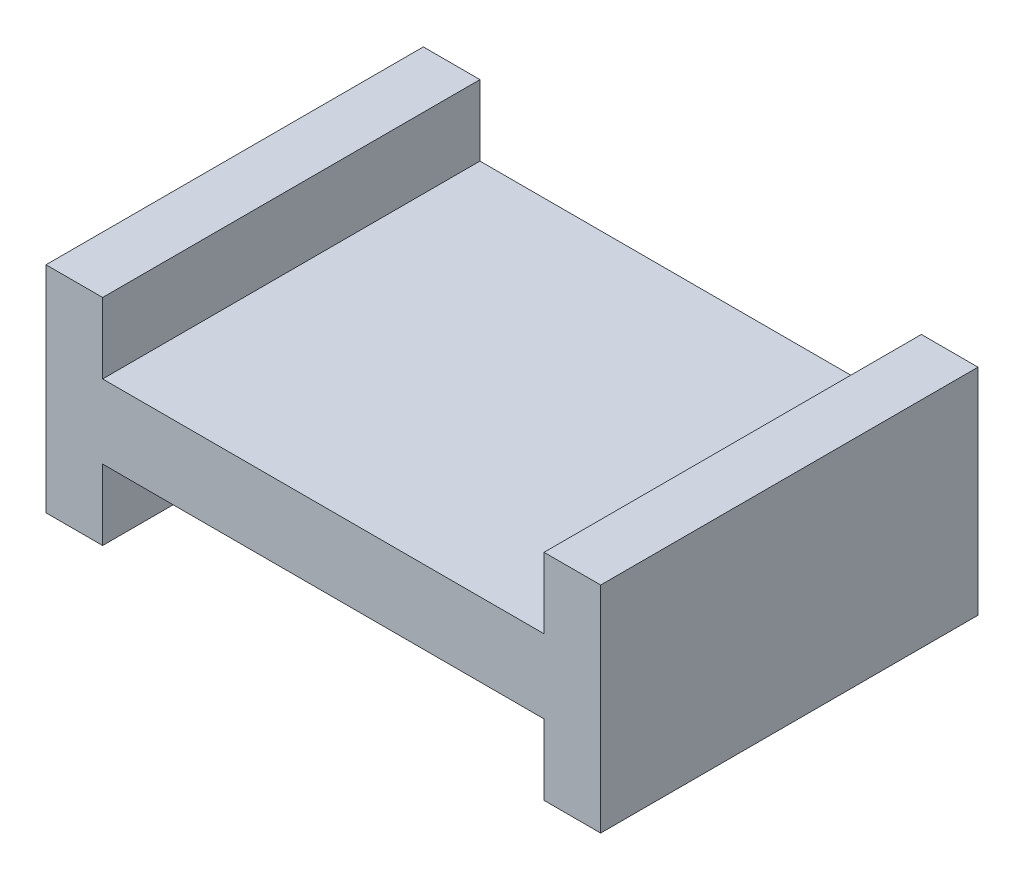
ISO-10303-21;
HEADER;
FILE_DESCRIPTION(('STEP AP214'),'2;1');
FILE_NAME('part.step','',(''),(''),'','','');
FILE_SCHEMA(('AUTOMOTIVE_DESIGN { 1 0 10303 214 1 1 1 1 }'));
ENDSEC;
DATA;
#1=APPLICATION_CONTEXT('core data for automotive mechanical design processes');
#2=APPLICATION_PROTOCOL_DEFINITION('international standard','automotive_design',2000,#1);
#3=PRODUCT_CONTEXT('',#1,'mechanical');
#4=PRODUCT('Part','Part','',(#3));
#5=PRODUCT_RELATED_PRODUCT_CATEGORY('part','',(#4));
#6=PRODUCT_DEFINITION_FORMATION('','',#4);
#7=PRODUCT_DEFINITION_CONTEXT('part definition',#1,'design');
#8=PRODUCT_DEFINITION('design','',#6,#7);
#9=PRODUCT_DEFINITION_SHAPE('','',#8);
#10=(LENGTH_UNIT() NAMED_UNIT(*) SI_UNIT(.MILLI.,.METRE.));
#11=(NAMED_UNIT(*) PLANE_ANGLE_UNIT() SI_UNIT($,.RADIAN.));
#12=(NAMED_UNIT(*) SI_UNIT($,.STERADIAN.) SOLID_ANGLE_UNIT());
#13=UNCERTAINTY_MEASURE_WITH_UNIT(LENGTH_MEASURE(1.E-05),#10,'distance_accuracy_value','');
#14=(GEOMETRIC_REPRESENTATION_CONTEXT(3) GLOBAL_UNCERTAINTY_ASSIGNED_CONTEXT((#13)) GLOBAL_UNIT_ASSIGNED_CONTEXT((#10,
#11,#12)) REPRESENTATION_CONTEXT('',''));
#15=CARTESIAN_POINT('',(0.,0.,0.));
#16=DIRECTION('',(0.,0.,1.));
#17=DIRECTION('',(1.,0.,0.));
#18=AXIS2_PLACEMENT_3D('',#15,#16,#17);
#19=CARTESIAN_POINT('',(-0.18332873911752,-0.882096055514072,0.));
#20=DIRECTION('',(0.,1.,0.));
#21=DIRECTION('',(-1.,0.,0.));
#22=AXIS2_PLACEMENT_3D('',#19,#20,#21);
#23=PLANE('',#22);
#24=DIRECTION('',(1.,0.,0.));
#25=VECTOR('',#24,1.);
#26=CARTESIAN_POINT('',(-0.19833846471974,-0.882096055514072,0.));
#27=LINE('',#26,#25);
#28=CARTESIAN_POINT('',(-0.19833846471974,-0.882096055514072,0.));
#29=VERTEX_POINT('',#28);
#30=CARTESIAN_POINT('',(-0.18332873911752,-0.882096055514072,0.));
#31=VERTEX_POINT('',#30);
#32=EDGE_CURVE('E11',#29,#31,#27,.T.);
#33=ORIENTED_EDGE('',*,*,#32,.F.);
#34=DIRECTION('',(0.,0.,1.));
#35=VECTOR('',#34,1.);
#36=CARTESIAN_POINT('',(-0.19833846471974,-0.882096055514072,0.));
#37=LINE('',#36,#35);
#38=CARTESIAN_POINT('',(-0.19833846471974,-0.882096055514072,0.1));
#39=VERTEX_POINT('',#38);
#40=EDGE_CURVE('E201',#29,#39,#37,.T.);
#41=ORIENTED_EDGE('',*,*,#40,.T.);
#42=DIRECTION('',(-1.,0.,0.));
#43=VECTOR('',#42,1.);
#44=CARTESIAN_POINT('',(-0.18332873911752,-0.882096055514072,0.1));
#45=LINE('',#44,#43);
#46=CARTESIAN_POINT('',(-0.18332873911752,-0.882096055514072,0.1));
#47=VERTEX_POINT('',#46);
#48=EDGE_CURVE('E127',#47,#39,#45,.T.);
#49=ORIENTED_EDGE('',*,*,#48,.F.);
#50=DIRECTION('',(0.,0.,1.));
#51=VECTOR('',#50,1.);
#52=CARTESIAN_POINT('',(-0.18332873911752,-0.882096055514072,0.));
#53=LINE('',#52,#51);
#54=EDGE_CURVE('E196',#31,#47,#53,.T.);
#55=ORIENTED_EDGE('',*,*,#54,.F.);
#56=EDGE_LOOP('',(#33,#41,#49,#55));
#57=FACE_BOUND('',#56,.T.);
#58=ADVANCED_FACE('F17',(#57),#23,.T.);
#59=CARTESIAN_POINT('',(-0.18332873911752,-0.900798650113664,0.));
#60=DIRECTION('',(1.,0.,0.));
#61=DIRECTION('',(0.,1.,0.));
#62=AXIS2_PLACEMENT_3D('',#59,#60,#61);
#63=PLANE('',#62);
#64=DIRECTION('',(0.,-1.,0.));
#65=VECTOR('',#64,1.);
#66=CARTESIAN_POINT('',(-0.18332873911752,-0.882096055514072,0.));
#67=LINE('',#66,#65);
#68=CARTESIAN_POINT('',(-0.18332873911752,-0.900798650113664,0.));
#69=VERTEX_POINT('',#68);
#70=EDGE_CURVE('E24',#31,#69,#67,.T.);
#71=ORIENTED_EDGE('',*,*,#70,.F.);
#72=ORIENTED_EDGE('',*,*,#54,.T.);
#73=DIRECTION('',(0.,1.,0.));
#74=VECTOR('',#73,1.);
#75=CARTESIAN_POINT('',(-0.18332873911752,-0.900798650113664,0.1));
#76=LINE('',#75,#74);
#77=CARTESIAN_POINT('',(-0.18332873911752,-0.900798650113664,0.1));
#78=VERTEX_POINT('',#77);
#79=EDGE_CURVE('E188',#78,#47,#76,.T.);
#80=ORIENTED_EDGE('',*,*,#79,.F.);
#81=DIRECTION('',(0.,0.,1.));
#82=VECTOR('',#81,1.);
#83=CARTESIAN_POINT('',(-0.18332873911752,-0.900798650113664,0.));
#84=LINE('',#83,#82);
#85=EDGE_CURVE('E190',#69,#78,#84,.T.);
#86=ORIENTED_EDGE('',*,*,#85,.F.);
#87=EDGE_LOOP('',(#71,#72,#80,#86));
#88=FACE_BOUND('',#87,.T.);
#89=ADVANCED_FACE('F206',(#88),#63,.T.);
#90=CARTESIAN_POINT('',(-0.0663481792652987,-0.900798650113664,0.));
#91=DIRECTION('',(0.,1.,0.));
#92=DIRECTION('',(-1.,0.,0.));
#93=AXIS2_PLACEMENT_3D('',#90,#91,#92);
#94=PLANE('',#93);
#95=DIRECTION('',(1.,0.,0.));
#96=VECTOR('',#95,1.);
#97=CARTESIAN_POINT('',(-0.18332873911752,-0.900798650113664,0.));
#98=LINE('',#97,#96);
#99=CARTESIAN_POINT('',(-0.0663481792652987,-0.900798650113664,0.));
#100=VERTEX_POINT('',#99);
#101=EDGE_CURVE('E198',#69,#100,#98,.T.);
#102=ORIENTED_EDGE('',*,*,#101,.F.);
#103=ORIENTED_EDGE('',*,*,#85,.T.);
#104=DIRECTION('',(-1.,0.,0.));
#105=VECTOR('',#104,1.);
#106=CARTESIAN_POINT('',(-0.0663481792652987,-0.900798650113664,0.1));
#107=LINE('',#106,#105);
#108=CARTESIAN_POINT('',(-0.0663481792652987,-0.900798650113664,0.1));
#109=VERTEX_POINT('',#108);
#110=EDGE_CURVE('E180',#109,#78,#107,.T.);
#111=ORIENTED_EDGE('',*,*,#110,.F.);
#112=DIRECTION('',(0.,0.,1.));
#113=VECTOR('',#112,1.);
#114=CARTESIAN_POINT('',(-0.0663481792652987,-0.900798650113664,0.));
#115=LINE('',#114,#113);
#116=EDGE_CURVE('E183',#100,#109,#115,.T.);
#117=ORIENTED_EDGE('',*,*,#116,.F.);
#118=EDGE_LOOP('',(#102,#103,#111,#117));
#119=FACE_BOUND('',#118,.T.);
#120=ADVANCED_FACE('F208',(#119),#94,.T.);
#121=CARTESIAN_POINT('',(-0.0663481792652987,-0.882096055514072,0.));
#122=DIRECTION('',(-1.,0.,0.));
#123=DIRECTION('',(0.,-1.,0.));
#124=AXIS2_PLACEMENT_3D('',#121,#122,#123);
#125=PLANE('',#124);
#126=DIRECTION('',(0.,1.,0.));
#127=VECTOR('',#126,1.);
#128=CARTESIAN_POINT('',(-0.0663481792652987,-0.900798650113664,0.));
#129=LINE('',#128,#127);
#130=CARTESIAN_POINT('',(-0.0663481792652987,-0.882096055514072,0.));
#131=VERTEX_POINT('',#130);
#132=EDGE_CURVE('E192',#100,#131,#129,.T.);
#133=ORIENTED_EDGE('',*,*,#132,.F.);
#134=ORIENTED_EDGE('',*,*,#116,.T.);
#135=DIRECTION('',(0.,-1.,0.));
#136=VECTOR('',#135,1.);
#137=CARTESIAN_POINT('',(-0.0663481792652987,-0.882096055514072,0.1));
#138=LINE('',#137,#136);
#139=CARTESIAN_POINT('',(-0.0663481792652987,-0.882096055514072,0.1));
#140=VERTEX_POINT('',#139);
#141=EDGE_CURVE('E172',#140,#109,#138,.T.);
#142=ORIENTED_EDGE('',*,*,#141,.F.);
#143=DIRECTION('',(0.,0.,1.));
#144=VECTOR('',#143,1.);
#145=CARTESIAN_POINT('',(-0.0663481792652987,-0.882096055514072,0.));
#146=LINE('',#145,#144);
#147=EDGE_CURVE('E175',#131,#140,#146,.T.);
#148=ORIENTED_EDGE('',*,*,#147,.F.);
#149=EDGE_LOOP('',(#133,#134,#142,#148));
#150=FACE_BOUND('',#149,.T.);
#151=ADVANCED_FACE('F212',(#150),#125,.T.);
#152=CARTESIAN_POINT('',(-0.0513384536630788,-0.882096055514072,0.));
#153=DIRECTION('',(0.,1.,0.));
#154=DIRECTION('',(-1.,0.,0.));
#155=AXIS2_PLACEMENT_3D('',#152,#153,#154);
#156=PLANE('',#155);
#157=DIRECTION('',(1.,0.,0.));
#158=VECTOR('',#157,1.);
#159=CARTESIAN_POINT('',(-0.0663481792652987,-0.882096055514072,0.));
#160=LINE('',#159,#158);
#161=CARTESIAN_POINT('',(-0.0513384536630788,-0.882096055514072,0.));
#162=VERTEX_POINT('',#161);
#163=EDGE_CURVE('E185',#131,#162,#160,.T.);
#164=ORIENTED_EDGE('',*,*,#163,.F.);
#165=ORIENTED_EDGE('',*,*,#147,.T.);
#166=DIRECTION('',(-1.,0.,0.));
#167=VECTOR('',#166,1.);
#168=CARTESIAN_POINT('',(-0.0513384536630788,-0.882096055514072,0.1));
#169=LINE('',#168,#167);
#170=CARTESIAN_POINT('',(-0.0513384536630788,-0.882096055514072,0.1));
#171=VERTEX_POINT('',#170);
#172=EDGE_CURVE('E164',#171,#140,#169,.T.);
#173=ORIENTED_EDGE('',*,*,#172,.F.);
#174=DIRECTION('',(0.,0.,1.));
#175=VECTOR('',#174,1.);
#176=CARTESIAN_POINT('',(-0.0513384536630788,-0.882096055514072,0.));
#177=LINE('',#176,#175);
#178=EDGE_CURVE('E167',#162,#171,#177,.T.);
#179=ORIENTED_EDGE('',*,*,#178,.F.);
#180=EDGE_LOOP('',(#164,#165,#173,#179));
#181=FACE_BOUND('',#180,.T.);
#182=ADVANCED_FACE('F216',(#181),#156,.T.);
#183=CARTESIAN_POINT('',(-0.0513384536630787,-0.939037712957414,0.));
#184=DIRECTION('',(1.,0.,0.));
#185=DIRECTION('',(0.,1.,0.));
#186=AXIS2_PLACEMENT_3D('',#183,#184,#185);
#187=PLANE('',#186);
#188=DIRECTION('',(0.,-1.,0.));
#189=VECTOR('',#188,1.);
#190=CARTESIAN_POINT('',(-0.0513384536630788,-0.882096055514072,0.));
#191=LINE('',#190,#189);
#192=CARTESIAN_POINT('',(-0.0513384536630787,-0.939037712957414,0.));
#193=VERTEX_POINT('',#192);
#194=EDGE_CURVE('E177',#162,#193,#191,.T.);
#195=ORIENTED_EDGE('',*,*,#194,.F.);
#196=ORIENTED_EDGE('',*,*,#178,.T.);
#197=DIRECTION('',(0.,1.,0.));
#198=VECTOR('',#197,1.);
#199=CARTESIAN_POINT('',(-0.0513384536630787,-0.939037712957414,0.1));
#200=LINE('',#199,#198);
#201=CARTESIAN_POINT('',(-0.0513384536630787,-0.939037712957414,0.1));
#202=VERTEX_POINT('',#201);
#203=EDGE_CURVE('E156',#202,#171,#200,.T.);
#204=ORIENTED_EDGE('',*,*,#203,.F.);
#205=DIRECTION('',(0.,0.,1.));
#206=VECTOR('',#205,1.);
#207=CARTESIAN_POINT('',(-0.0513384536630787,-0.939037712957414,0.));
#208=LINE('',#207,#206);
#209=EDGE_CURVE('E159',#193,#202,#208,.T.);
#210=ORIENTED_EDGE('',*,*,#209,.F.);
#211=EDGE_LOOP('',(#195,#196,#204,#210));
#212=FACE_BOUND('',#211,.T.);
#213=ADVANCED_FACE('F220',(#212),#187,.T.);
#214=CARTESIAN_POINT('',(-0.0663481792652986,-0.939037712957414,0.));
#215=DIRECTION('',(0.,-1.,0.));
#216=DIRECTION('',(1.,0.,0.));
#217=AXIS2_PLACEMENT_3D('',#214,#215,#216);
#218=PLANE('',#217);
#219=DIRECTION('',(-1.,0.,0.));
#220=VECTOR('',#219,1.);
#221=CARTESIAN_POINT('',(-0.0513384536630787,-0.939037712957414,0.));
#222=LINE('',#221,#220);
#223=CARTESIAN_POINT('',(-0.0663481792652986,-0.939037712957414,0.));
#224=VERTEX_POINT('',#223);
#225=EDGE_CURVE('E169',#193,#224,#222,.T.);
#226=ORIENTED_EDGE('',*,*,#225,.F.);
#227=ORIENTED_EDGE('',*,*,#209,.T.);
#228=DIRECTION('',(1.,0.,0.));
#229=VECTOR('',#228,1.);
#230=CARTESIAN_POINT('',(-0.0663481792652986,-0.939037712957414,0.1));
#231=LINE('',#230,#229);
#232=CARTESIAN_POINT('',(-0.0663481792652986,-0.939037712957414,0.1));
#233=VERTEX_POINT('',#232);
#234=EDGE_CURVE('E148',#233,#202,#231,.T.);
#235=ORIENTED_EDGE('',*,*,#234,.F.);
#236=DIRECTION('',(0.,0.,1.));
#237=VECTOR('',#236,1.);
#238=CARTESIAN_POINT('',(-0.0663481792652986,-0.939037712957414,0.));
#239=LINE('',#238,#237);
#240=EDGE_CURVE('E151',#224,#233,#239,.T.);
#241=ORIENTED_EDGE('',*,*,#240,.F.);
#242=EDGE_LOOP('',(#226,#227,#235,#241));
#243=FACE_BOUND('',#242,.T.);
#244=ADVANCED_FACE('F224',(#243),#218,.T.);
#245=CARTESIAN_POINT('',(-0.0663481792652987,-0.920335118357823,0.));
#246=DIRECTION('',(-1.,0.,0.));
#247=DIRECTION('',(0.,-1.,0.));
#248=AXIS2_PLACEMENT_3D('',#245,#246,#247);
#249=PLANE('',#248);
#250=DIRECTION('',(0.,1.,0.));
#251=VECTOR('',#250,1.);
#252=CARTESIAN_POINT('',(-0.0663481792652986,-0.939037712957414,0.));
#253=LINE('',#252,#251);
#254=CARTESIAN_POINT('',(-0.0663481792652987,-0.920335118357823,0.));
#255=VERTEX_POINT('',#254);
#256=EDGE_CURVE('E161',#224,#255,#253,.T.);
#257=ORIENTED_EDGE('',*,*,#256,.F.);
#258=ORIENTED_EDGE('',*,*,#240,.T.);
#259=DIRECTION('',(0.,-1.,0.));
#260=VECTOR('',#259,1.);
#261=CARTESIAN_POINT('',(-0.0663481792652987,-0.920335118357823,0.1));
#262=LINE('',#261,#260);
#263=CARTESIAN_POINT('',(-0.0663481792652987,-0.920335118357823,0.1));
#264=VERTEX_POINT('',#263);
#265=EDGE_CURVE('E140',#264,#233,#262,.T.);
#266=ORIENTED_EDGE('',*,*,#265,.F.);
#267=DIRECTION('',(0.,0.,1.));
#268=VECTOR('',#267,1.);
#269=CARTESIAN_POINT('',(-0.0663481792652987,-0.920335118357823,0.));
#270=LINE('',#269,#268);
#271=EDGE_CURVE('E143',#255,#264,#270,.T.);
#272=ORIENTED_EDGE('',*,*,#271,.F.);
#273=EDGE_LOOP('',(#257,#258,#266,#272));
#274=FACE_BOUND('',#273,.T.);
#275=ADVANCED_FACE('F228',(#274),#249,.T.);
#276=CARTESIAN_POINT('',(-0.18332873911752,-0.920335118357823,0.));
#277=DIRECTION('',(0.,-1.,0.));
#278=DIRECTION('',(1.,0.,0.));
#279=AXIS2_PLACEMENT_3D('',#276,#277,#278);
#280=PLANE('',#279);
#281=DIRECTION('',(-1.,0.,0.));
#282=VECTOR('',#281,1.);
#283=CARTESIAN_POINT('',(-0.0663481792652987,-0.920335118357823,0.));
#284=LINE('',#283,#282);
#285=CARTESIAN_POINT('',(-0.18332873911752,-0.920335118357823,0.));
#286=VERTEX_POINT('',#285);
#287=EDGE_CURVE('E153',#255,#286,#284,.T.);
#288=ORIENTED_EDGE('',*,*,#287,.F.);
#289=ORIENTED_EDGE('',*,*,#271,.T.);
#290=DIRECTION('',(1.,0.,0.));
#291=VECTOR('',#290,1.);
#292=CARTESIAN_POINT('',(-0.18332873911752,-0.920335118357823,0.1));
#293=LINE('',#292,#291);
#294=CARTESIAN_POINT('',(-0.18332873911752,-0.920335118357823,0.1));
#295=VERTEX_POINT('',#294);
#296=EDGE_CURVE('E133',#295,#264,#293,.T.);
#297=ORIENTED_EDGE('',*,*,#296,.F.);
#298=DIRECTION('',(0.,0.,1.));
#299=VECTOR('',#298,1.);
#300=CARTESIAN_POINT('',(-0.18332873911752,-0.920335118357823,0.));
#301=LINE('',#300,#299);
#302=EDGE_CURVE('E136',#286,#295,#301,.T.);
#303=ORIENTED_EDGE('',*,*,#302,.F.);
#304=EDGE_LOOP('',(#288,#289,#297,#303));
#305=FACE_BOUND('',#304,.T.);
#306=ADVANCED_FACE('F232',(#305),#280,.T.);
#307=CARTESIAN_POINT('',(-0.18332873911752,-0.939037712957415,0.));
#308=DIRECTION('',(1.,0.,0.));
#309=DIRECTION('',(0.,1.,0.));
#310=AXIS2_PLACEMENT_3D('',#307,#308,#309);
#311=PLANE('',#310);
#312=DIRECTION('',(0.,-1.,0.));
#313=VECTOR('',#312,1.);
#314=CARTESIAN_POINT('',(-0.18332873911752,-0.920335118357823,0.));
#315=LINE('',#314,#313);
#316=CARTESIAN_POINT('',(-0.18332873911752,-0.939037712957415,0.));
#317=VERTEX_POINT('',#316);
#318=EDGE_CURVE('E145',#286,#317,#315,.T.);
#319=ORIENTED_EDGE('',*,*,#318,.F.);
#320=ORIENTED_EDGE('',*,*,#302,.T.);
#321=DIRECTION('',(0.,1.,0.));
#322=VECTOR('',#321,1.);
#323=CARTESIAN_POINT('',(-0.18332873911752,-0.939037712957415,0.1));
#324=LINE('',#323,#322);
#325=CARTESIAN_POINT('',(-0.18332873911752,-0.939037712957415,0.1));
#326=VERTEX_POINT('',#325);
#327=EDGE_CURVE('E113',#326,#295,#324,.T.);
#328=ORIENTED_EDGE('',*,*,#327,.F.);
#329=DIRECTION('',(0.,0.,1.));
#330=VECTOR('',#329,1.);
#331=CARTESIAN_POINT('',(-0.18332873911752,-0.939037712957415,0.));
#332=LINE('',#331,#330);
#333=EDGE_CURVE('E119',#317,#326,#332,.T.);
#334=ORIENTED_EDGE('',*,*,#333,.F.);
#335=EDGE_LOOP('',(#319,#320,#328,#334));
#336=FACE_BOUND('',#335,.T.);
#337=ADVANCED_FACE('F235',(#336),#311,.T.);
#338=CARTESIAN_POINT('',(-0.19833846471974,-0.939037712957415,0.));
#339=DIRECTION('',(0.,-1.,0.));
#340=DIRECTION('',(1.,0.,0.));
#341=AXIS2_PLACEMENT_3D('',#338,#339,#340);
#342=PLANE('',#341);
#343=DIRECTION('',(-1.,0.,0.));
#344=VECTOR('',#343,1.);
#345=CARTESIAN_POINT('',(-0.18332873911752,-0.939037712957415,0.));
#346=LINE('',#345,#344);
#347=CARTESIAN_POINT('',(-0.19833846471974,-0.939037712957415,0.));
#348=VERTEX_POINT('',#347);
#349=EDGE_CURVE('E138',#317,#348,#346,.T.);
#350=ORIENTED_EDGE('',*,*,#349,.F.);
#351=ORIENTED_EDGE('',*,*,#333,.T.);
#352=DIRECTION('',(1.,0.,0.));
#353=VECTOR('',#352,1.);
#354=CARTESIAN_POINT('',(-0.19833846471974,-0.939037712957415,0.1));
#355=LINE('',#354,#353);
#356=CARTESIAN_POINT('',(-0.19833846471974,-0.939037712957415,0.1));
#357=VERTEX_POINT('',#356);
#358=EDGE_CURVE('E114',#357,#326,#355,.T.);
#359=ORIENTED_EDGE('',*,*,#358,.F.);
#360=DIRECTION('',(0.,0.,1.));
#361=VECTOR('',#360,1.);
#362=CARTESIAN_POINT('',(-0.19833846471974,-0.939037712957415,0.));
#363=LINE('',#362,#361);
#364=EDGE_CURVE('E103',#348,#357,#363,.T.);
#365=ORIENTED_EDGE('',*,*,#364,.F.);
#366=EDGE_LOOP('',(#350,#351,#359,#365));
#367=FACE_BOUND('',#366,.T.);
#368=ADVANCED_FACE('F117',(#367),#342,.T.);
#369=CARTESIAN_POINT('',(-0.19833846471974,-0.882096055514072,0.));
#370=DIRECTION('',(-1.,0.,0.));
#371=DIRECTION('',(0.,-1.,0.));
#372=AXIS2_PLACEMENT_3D('',#369,#370,#371);
#373=PLANE('',#372);
#374=DIRECTION('',(0.,1.,0.));
#375=VECTOR('',#374,1.);
#376=CARTESIAN_POINT('',(-0.19833846471974,-0.939037712957415,0.));
#377=LINE('',#376,#375);
#378=EDGE_CURVE('E110',#348,#29,#377,.T.);
#379=ORIENTED_EDGE('',*,*,#378,.F.);
#380=ORIENTED_EDGE('',*,*,#364,.T.);
#381=DIRECTION('',(0.,-1.,0.));
#382=VECTOR('',#381,1.);
#383=CARTESIAN_POINT('',(-0.19833846471974,-0.882096055514072,0.1));
#384=LINE('',#383,#382);
#385=EDGE_CURVE('E108',#39,#357,#384,.T.);
#386=ORIENTED_EDGE('',*,*,#385,.F.);
#387=ORIENTED_EDGE('',*,*,#40,.F.);
#388=EDGE_LOOP('',(#379,#380,#386,#387));
#389=FACE_BOUND('',#388,.T.);
#390=ADVANCED_FACE('F105',(#389),#373,.T.);
#391=CARTESIAN_POINT('',(-0.12483845919141,-0.910566884235744,0.));
#392=DIRECTION('',(0.,0.,1.));
#393=DIRECTION('',(1.,0.,0.));
#394=AXIS2_PLACEMENT_3D('',#391,#392,#393);
#395=PLANE('',#394);
#396=ORIENTED_EDGE('',*,*,#378,.T.);
#397=ORIENTED_EDGE('',*,*,#32,.T.);
#398=ORIENTED_EDGE('',*,*,#70,.T.);
#399=ORIENTED_EDGE('',*,*,#101,.T.);
#400=ORIENTED_EDGE('',*,*,#132,.T.);
#401=ORIENTED_EDGE('',*,*,#163,.T.);
#402=ORIENTED_EDGE('',*,*,#194,.T.);
#403=ORIENTED_EDGE('',*,*,#225,.T.);
#404=ORIENTED_EDGE('',*,*,#256,.T.);
#405=ORIENTED_EDGE('',*,*,#287,.T.);
#406=ORIENTED_EDGE('',*,*,#318,.T.);
#407=ORIENTED_EDGE('',*,*,#349,.T.);
#408=EDGE_LOOP('',(#396,#397,#398,#399,#400,#401,#402,#403,#404,#405,#406,#407));
#409=FACE_BOUND('',#408,.T.);
#410=ADVANCED_FACE('F203',(#409),#395,.F.);
#411=CARTESIAN_POINT('',(-0.12483845919141,-0.910566884235744,0.1));
#412=DIRECTION('',(0.,0.,1.));
#413=DIRECTION('',(1.,0.,0.));
#414=AXIS2_PLACEMENT_3D('',#411,#412,#413);
#415=PLANE('',#414);
#416=ORIENTED_EDGE('',*,*,#385,.T.);
#417=ORIENTED_EDGE('',*,*,#358,.T.);
#418=ORIENTED_EDGE('',*,*,#327,.T.);
#419=ORIENTED_EDGE('',*,*,#296,.T.);
#420=ORIENTED_EDGE('',*,*,#265,.T.);
#421=ORIENTED_EDGE('',*,*,#234,.T.);
#422=ORIENTED_EDGE('',*,*,#203,.T.);
#423=ORIENTED_EDGE('',*,*,#172,.T.);
#424=ORIENTED_EDGE('',*,*,#141,.T.);
#425=ORIENTED_EDGE('',*,*,#110,.T.);
#426=ORIENTED_EDGE('',*,*,#79,.T.);
#427=ORIENTED_EDGE('',*,*,#48,.T.);
#428=EDGE_LOOP('',(#416,#417,#418,#419,#420,#421,#422,#423,#424,#425,#426,#427));
#429=FACE_BOUND('',#428,.T.);
#430=ADVANCED_FACE('F124',(#429),#415,.T.);
#431=CLOSED_SHELL('',(#58,#89,#120,#151,#182,#213,#244,#275,#306,#337,#368,#390,#410,#430));
#432=MANIFOLD_SOLID_BREP('B1',#431);
#433=ADVANCED_BREP_SHAPE_REPRESENTATION('',(#18,#432),#14);
#434=SHAPE_DEFINITION_REPRESENTATION(#9,#433);
ENDSEC;
END-ISO-10303-21;
